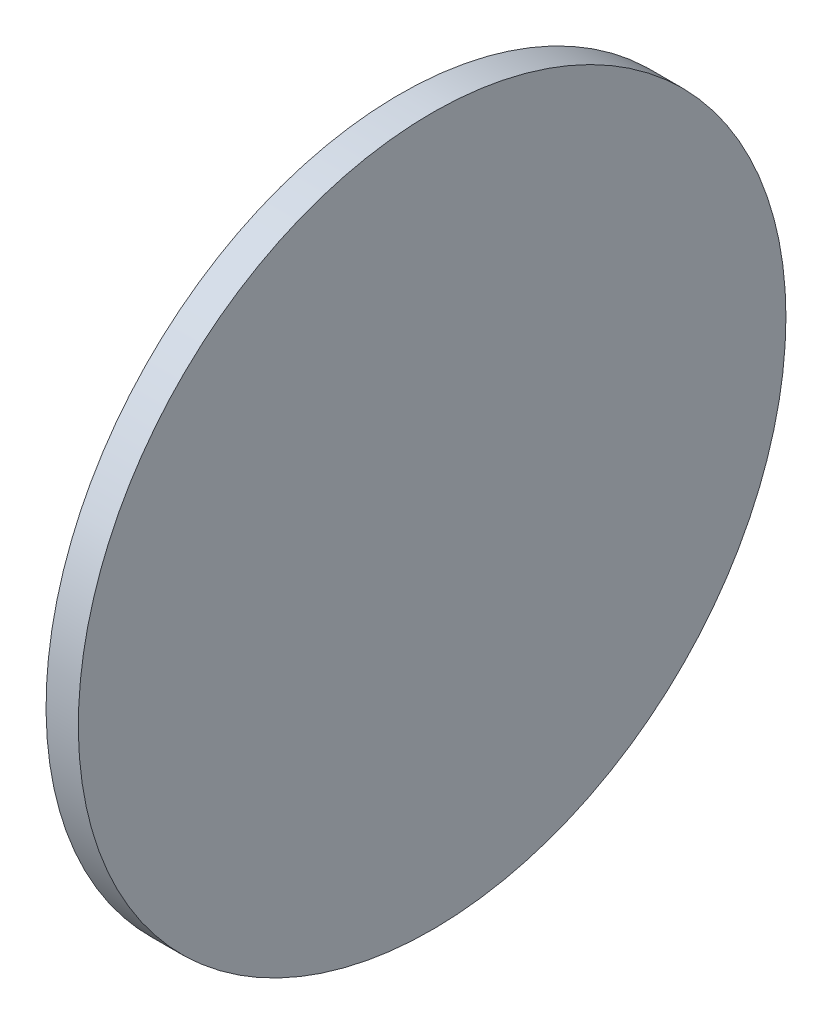
ISO-10303-21;
HEADER;
FILE_DESCRIPTION(('STEP AP214'),'2;1');
FILE_NAME('part.step','',(''),(''),'','','');
FILE_SCHEMA(('AUTOMOTIVE_DESIGN { 1 0 10303 214 1 1 1 1 }'));
ENDSEC;
DATA;
#1=APPLICATION_CONTEXT('core data for automotive mechanical design processes');
#2=APPLICATION_PROTOCOL_DEFINITION('international standard','automotive_design',2000,#1);
#3=PRODUCT_CONTEXT('',#1,'mechanical');
#4=PRODUCT('Part','Part','',(#3));
#5=PRODUCT_RELATED_PRODUCT_CATEGORY('part','',(#4));
#6=PRODUCT_DEFINITION_FORMATION('','',#4);
#7=PRODUCT_DEFINITION_CONTEXT('part definition',#1,'design');
#8=PRODUCT_DEFINITION('design','',#6,#7);
#9=PRODUCT_DEFINITION_SHAPE('','',#8);
#10=(LENGTH_UNIT() NAMED_UNIT(*) SI_UNIT(.MILLI.,.METRE.));
#11=(NAMED_UNIT(*) PLANE_ANGLE_UNIT() SI_UNIT($,.RADIAN.));
#12=(NAMED_UNIT(*) SI_UNIT($,.STERADIAN.) SOLID_ANGLE_UNIT());
#13=UNCERTAINTY_MEASURE_WITH_UNIT(LENGTH_MEASURE(1.E-05),#10,'distance_accuracy_value','');
#14=(GEOMETRIC_REPRESENTATION_CONTEXT(3) GLOBAL_UNCERTAINTY_ASSIGNED_CONTEXT((#13)) GLOBAL_UNIT_ASSIGNED_CONTEXT((#10,
#11,#12)) REPRESENTATION_CONTEXT('',''));
#15=CARTESIAN_POINT('',(0.,0.,0.));
#16=DIRECTION('',(0.,0.,1.));
#17=DIRECTION('',(1.,0.,0.));
#18=AXIS2_PLACEMENT_3D('',#15,#16,#17);
#19=CARTESIAN_POINT('',(160.522187488151,22.6971380761825,534.770617253154));
#20=CARTESIAN_POINT('',(160.522187488151,24.6488522827371,534.770617253154));
#21=CARTESIAN_POINT('',(160.522187488151,28.5522806958463,535.155071395465));
#22=CARTESIAN_POINT('',(160.522187488151,34.1824134682382,536.862953500239));
#23=CARTESIAN_POINT('',(160.522187488151,39.3711735483301,539.636403544825));
#24=CARTESIAN_POINT('',(160.522187488151,43.9191597961341,543.368839399378));
#25=CARTESIAN_POINT('',(160.522187488151,47.6515956506874,547.916825647182));
#26=CARTESIAN_POINT('',(160.522187488151,50.4250456952734,553.105585727274));
#27=CARTESIAN_POINT('',(160.522187488151,52.1329278000475,558.735718499666));
#28=CARTESIAN_POINT('',(160.522187488151,52.7096090135145,564.59086111933));
#29=CARTESIAN_POINT('',(160.522187488151,52.1329278000475,570.446003738994));
#30=CARTESIAN_POINT('',(160.522187488151,50.4250456952734,576.076136511386));
#31=CARTESIAN_POINT('',(160.522187488151,47.6515956506874,581.264896591478));
#32=CARTESIAN_POINT('',(160.522187488151,43.9191597961341,585.812882839282));
#33=CARTESIAN_POINT('',(160.522187488151,39.3711735483301,589.545318693835));
#34=CARTESIAN_POINT('',(160.522187488151,34.1824134682382,592.318768738421));
#35=CARTESIAN_POINT('',(160.522187488151,28.5522806958463,594.026650843195));
#36=CARTESIAN_POINT('',(160.522187488151,22.6971380761824,594.603332056662));
#37=CARTESIAN_POINT('',(160.522187488151,16.8419954565187,594.026650843195));
#38=CARTESIAN_POINT('',(160.522187488151,11.2118626841267,592.318768738421));
#39=CARTESIAN_POINT('',(160.522187488151,6.02310260403484,589.545318693835));
#40=CARTESIAN_POINT('',(160.522187488151,1.47511635623078,585.812882839282));
#41=CARTESIAN_POINT('',(160.522187488151,-2.25731949832244,581.264896591478));
#42=CARTESIAN_POINT('',(160.522187488151,-5.03076954290849,576.076136511386));
#43=CARTESIAN_POINT('',(160.522187488151,-6.73865164768257,570.446003738994));
#44=CARTESIAN_POINT('',(160.522187488151,-7.31533286114962,564.59086111933));
#45=CARTESIAN_POINT('',(160.522187488151,-6.73865164768257,558.735718499666));
#46=CARTESIAN_POINT('',(160.522187488151,-5.0307695429085,553.105585727274));
#47=CARTESIAN_POINT('',(160.522187488151,-2.25731949832244,547.916825647182));
#48=CARTESIAN_POINT('',(160.522187488151,1.47511635623078,543.368839399378));
#49=CARTESIAN_POINT('',(160.522187488151,6.02310260403483,539.636403544825));
#50=CARTESIAN_POINT('',(160.522187488151,11.2118626841267,536.862953500239));
#51=CARTESIAN_POINT('',(160.522187488151,16.8419954565186,535.155071395465));
#52=CARTESIAN_POINT('',(160.522187488151,20.7454238696279,534.770617253154));
#53=CARTESIAN_POINT('',(160.522187488151,22.6971380761825,534.770617253154));
#54=B_SPLINE_CURVE_WITH_KNOTS('',3,(#19,#20,#21,#22,#23,#24,#25,#26,#27,#28,#29,#30,#31,#32,#33,
#34,#35,#36,#37,#38,#39,#40,#41,#42,#43,#44,#45,#46,#47,#48,#49,#50,#51,#52,#53),.UNSPECIFIED.,
.T.,.F.,(4,1,1,1,1,1,1,1,1,1,1,1,1,1,1,1,1,1,1,1,1,1,1,1,1,1,1,1,1,1,1,1,4),(0.,0.03125,
0.0625000000000001,0.09375,0.125,0.15625,0.1875,0.21875,0.25,0.28125,0.3125,0.34375,0.375,
0.40625,0.4375,0.46875,0.5,0.53125,0.5625,0.59375,0.625,0.65625,0.6875,0.71875,0.75,0.78125,
0.8125,0.84375,0.875,0.90625,0.9375,0.96875,1.),.UNSPECIFIED.);
#55=DIRECTION('',(1.,0.,0.));
#56=VECTOR('',#55,1.);
#57=SURFACE_OF_LINEAR_EXTRUSION('',#54,#56);
#58=CARTESIAN_POINT('',(160.522187488151,22.6971380761825,534.770617253154));
#59=CARTESIAN_POINT('',(160.522187488151,24.6488522827371,534.770617253154));
#60=CARTESIAN_POINT('',(160.522187488151,28.5522806958463,535.155071395465));
#61=CARTESIAN_POINT('',(160.522187488151,34.1824134682382,536.862953500239));
#62=CARTESIAN_POINT('',(160.522187488151,39.3711735483301,539.636403544825));
#63=CARTESIAN_POINT('',(160.522187488151,43.9191597961341,543.368839399378));
#64=CARTESIAN_POINT('',(160.522187488151,47.6515956506874,547.916825647182));
#65=CARTESIAN_POINT('',(160.522187488151,50.4250456952734,553.105585727274));
#66=CARTESIAN_POINT('',(160.522187488151,52.1329278000475,558.735718499666));
#67=CARTESIAN_POINT('',(160.522187488151,52.7096090135145,564.59086111933));
#68=CARTESIAN_POINT('',(160.522187488151,52.1329278000475,570.446003738994));
#69=CARTESIAN_POINT('',(160.522187488151,50.4250456952734,576.076136511386));
#70=CARTESIAN_POINT('',(160.522187488151,47.6515956506874,581.264896591478));
#71=CARTESIAN_POINT('',(160.522187488151,43.9191597961341,585.812882839282));
#72=CARTESIAN_POINT('',(160.522187488151,39.3711735483301,589.545318693835));
#73=CARTESIAN_POINT('',(160.522187488151,34.1824134682382,592.318768738421));
#74=CARTESIAN_POINT('',(160.522187488151,28.5522806958463,594.026650843195));
#75=CARTESIAN_POINT('',(160.522187488151,22.6971380761824,594.603332056662));
#76=CARTESIAN_POINT('',(160.522187488151,16.8419954565187,594.026650843195));
#77=CARTESIAN_POINT('',(160.522187488151,11.2118626841267,592.318768738421));
#78=CARTESIAN_POINT('',(160.522187488151,6.02310260403484,589.545318693835));
#79=CARTESIAN_POINT('',(160.522187488151,1.47511635623078,585.812882839282));
#80=CARTESIAN_POINT('',(160.522187488151,-2.25731949832244,581.264896591478));
#81=CARTESIAN_POINT('',(160.522187488151,-5.03076954290849,576.076136511386));
#82=CARTESIAN_POINT('',(160.522187488151,-6.73865164768257,570.446003738994));
#83=CARTESIAN_POINT('',(160.522187488151,-7.31533286114962,564.59086111933));
#84=CARTESIAN_POINT('',(160.522187488151,-6.73865164768257,558.735718499666));
#85=CARTESIAN_POINT('',(160.522187488151,-5.0307695429085,553.105585727274));
#86=CARTESIAN_POINT('',(160.522187488151,-2.25731949832244,547.916825647182));
#87=CARTESIAN_POINT('',(160.522187488151,1.47511635623078,543.368839399378));
#88=CARTESIAN_POINT('',(160.522187488151,6.02310260403483,539.636403544825));
#89=CARTESIAN_POINT('',(160.522187488151,11.2118626841267,536.862953500239));
#90=CARTESIAN_POINT('',(160.522187488151,16.8419954565186,535.155071395465));
#91=CARTESIAN_POINT('',(160.522187488151,20.7454238696279,534.770617253154));
#92=CARTESIAN_POINT('',(160.522187488151,22.6971380761825,534.770617253154));
#93=B_SPLINE_CURVE_WITH_KNOTS('',3,(#58,#59,#60,#61,#62,#63,#64,#65,#66,#67,#68,#69,#70,#71,#72,
#73,#74,#75,#76,#77,#78,#79,#80,#81,#82,#83,#84,#85,#86,#87,#88,#89,#90,#91,#92),.UNSPECIFIED.,
.T.,.F.,(4,1,1,1,1,1,1,1,1,1,1,1,1,1,1,1,1,1,1,1,1,1,1,1,1,1,1,1,1,1,1,1,4),(0.,0.03125,
0.0625000000000001,0.09375,0.125,0.15625,0.1875,0.21875,0.25,0.28125,0.3125,0.34375,0.375,
0.40625,0.4375,0.46875,0.5,0.53125,0.5625,0.59375,0.625,0.65625,0.6875,0.71875,0.75,0.78125,
0.8125,0.84375,0.875,0.90625,0.9375,0.96875,1.),.UNSPECIFIED.);
#94=CARTESIAN_POINT('',(160.522187488151,22.6971380761825,534.770617253154));
#95=VERTEX_POINT('',#94);
#96=EDGE_CURVE('E9',#95,#95,#93,.T.);
#97=ORIENTED_EDGE('',*,*,#96,.T.);
#98=EDGE_LOOP('',(#97));
#99=FACE_BOUND('',#98,.T.);
#100=CARTESIAN_POINT('',(163.243459452108,22.6971380761825,534.770617253154));
#101=CARTESIAN_POINT('',(163.243459452108,22.209206528486,534.770617354361));
#102=CARTESIAN_POINT('',(163.243459452108,21.7212785318932,534.78263158858));
#103=CARTESIAN_POINT('',(163.243459452108,20.746594451324,534.830572830946));
#104=CARTESIAN_POINT('',(163.243459452108,20.2598383764803,534.866500024844));
#105=CARTESIAN_POINT('',(163.243459452108,19.2886705665237,534.962151690879));
#106=CARTESIAN_POINT('',(163.243459452108,18.8042588314108,535.021876163015));
#107=CARTESIAN_POINT('',(163.243459452108,17.8389491504251,535.165007686582));
#108=CARTESIAN_POINT('',(163.243459452108,17.358051177287,535.248414554046));
#109=CARTESIAN_POINT('',(163.243459452108,16.4009430181742,535.438795200653));
#110=CARTESIAN_POINT('',(163.243459452108,15.9247328321996,535.545768979795));
#111=CARTESIAN_POINT('',(163.243459452108,14.9781288439774,535.78294074304));
#112=CARTESIAN_POINT('',(163.243459452108,14.5077350869397,535.91313890754));
#113=CARTESIAN_POINT('',(163.243459452108,13.5738889928545,536.196418022795));
#114=CARTESIAN_POINT('',(163.243459452108,13.1104366558071,536.34949897355));
#115=CARTESIAN_POINT('',(163.243459452108,12.1915986284864,536.678202860723));
#116=CARTESIAN_POINT('',(163.243459452108,11.7362128755807,536.85382562203));
#117=CARTESIAN_POINT('',(163.243459452108,10.8346367234395,537.227270691719));
#118=CARTESIAN_POINT('',(163.243459452108,10.388446324204,537.425093000102));
#119=CARTESIAN_POINT('',(163.243459452108,9.50630097637823,537.842380852682));
#120=CARTESIAN_POINT('',(163.243459452108,9.07034610732267,538.061846564989));
#121=CARTESIAN_POINT('',(163.243459452108,8.2097086193634,538.521866886316));
#122=CARTESIAN_POINT('',(163.243459452108,7.7850260004597,538.762421495336));
#123=CARTESIAN_POINT('',(163.243459452108,6.94797013499257,539.264065836217));
#124=CARTESIAN_POINT('',(163.243459452108,6.53559679283769,539.525155408549));
#125=CARTESIAN_POINT('',(163.243459452108,5.72419969266128,540.067313617757));
#126=CARTESIAN_POINT('',(163.243459452108,5.32517593463976,540.348382254631));
#127=CARTESIAN_POINT('',(163.243459452108,4.54138958382106,540.929750058112));
#128=CARTESIAN_POINT('',(163.243459452108,4.15662710182709,541.230049374082));
#129=CARTESIAN_POINT('',(163.243459452108,3.40227203450267,541.849132578589));
#130=CARTESIAN_POINT('',(163.243459452108,3.03267944917222,542.167916467126));
#131=CARTESIAN_POINT('',(163.243459452108,2.30957333344479,542.823223350999));
#132=CARTESIAN_POINT('',(163.243459452108,1.95605967817079,543.159746208522));
#133=CARTESIAN_POINT('',(163.243459452108,1.26602316537437,543.849782721318));
#134=CARTESIAN_POINT('',(163.243459452108,0.929500307851959,544.203296376592));
#135=CARTESIAN_POINT('',(163.243459452108,0.274193423978741,544.92640249232));
#136=CARTESIAN_POINT('',(163.243459452108,-0.0445904645585054,545.29599507765));
#137=CARTESIAN_POINT('',(163.243459452108,-0.663673669065741,546.050350144975));
#138=CARTESIAN_POINT('',(163.243459452108,-0.963972985035732,546.435112626969));
#139=CARTESIAN_POINT('',(163.243459452108,-1.54534078851656,547.218898977787));
#140=CARTESIAN_POINT('',(163.243459452108,-1.82640942539103,547.617922735809));
#141=CARTESIAN_POINT('',(163.243459452108,-2.36856763459819,548.429319835985));
#142=CARTESIAN_POINT('',(163.243459452108,-2.62965720693087,548.841693178139));
#143=CARTESIAN_POINT('',(163.243459452108,-3.13130154781153,549.678749043608));
#144=CARTESIAN_POINT('',(163.243459452108,-3.3718561568317,550.103431662515));
#145=CARTESIAN_POINT('',(163.243459452108,-3.83187647815847,550.964069150466));
#146=CARTESIAN_POINT('',(163.243459452108,-4.05134219046507,551.400024019511));
#147=CARTESIAN_POINT('',(163.243459452108,-4.4686300430463,552.282169367366));
#148=CARTESIAN_POINT('',(163.243459452108,-4.66645235143123,552.728359766642));
#149=CARTESIAN_POINT('',(163.243459452108,-5.03989742111512,553.629935918674));
#150=CARTESIAN_POINT('',(163.243459452108,-5.21552018241408,554.085321671431));
#151=CARTESIAN_POINT('',(163.243459452108,-5.54422406960754,555.004159699158));
#152=CARTESIAN_POINT('',(163.243459452108,-5.69730502039054,555.467612036761));
#153=CARTESIAN_POINT('',(163.243459452108,-5.9805841355706,556.401458129328));
#154=CARTESIAN_POINT('',(163.243459452108,-6.11078229996764,556.871851884293));
#155=CARTESIAN_POINT('',(163.243459452108,-6.34795406349232,557.818455878179));
#156=CARTESIAN_POINT('',(163.243459452108,-6.45492784301653,558.29466607189));
#157=CARTESIAN_POINT('',(163.243459452108,-6.64530848857962,559.251774209866));
#158=CARTESIAN_POINT('',(163.243459452108,-6.72871535461851,559.732672154131));
#159=CARTESIAN_POINT('',(163.243459452108,-6.87184688207918,560.697981914001));
#160=CARTESIAN_POINT('',(163.243459452108,-6.93157135953521,561.182393756873));
#161=CARTESIAN_POINT('',(163.243459452108,-7.02722301103694,562.153561272426));
#162=CARTESIAN_POINT('',(163.243459452108,-7.06315018508264,562.640316945107));
#163=CARTESIAN_POINT('',(163.243459452108,-7.11109148168599,563.615002124401));
#164=CARTESIAN_POINT('',(163.243459452108,-7.12310578999394,564.102931621865));
#165=CARTESIAN_POINT('',(163.243459452108,-7.12310578999393,565.078790616795));
#166=CARTESIAN_POINT('',(163.243459452108,-7.11109148168599,565.566720114259));
#167=CARTESIAN_POINT('',(163.243459452108,-7.06315018508264,566.541405293553));
#168=CARTESIAN_POINT('',(163.243459452108,-7.02722301103694,567.028160966234));
#169=CARTESIAN_POINT('',(163.243459452108,-6.93157135953521,567.999328481787));
#170=CARTESIAN_POINT('',(163.243459452108,-6.87184688207917,568.483740324659));
#171=CARTESIAN_POINT('',(163.243459452108,-6.72871535461851,569.44905008453));
#172=CARTESIAN_POINT('',(163.243459452108,-6.64530848857961,569.929948028794));
#173=CARTESIAN_POINT('',(163.243459452108,-6.45492784301652,570.88705616677));
#174=CARTESIAN_POINT('',(163.243459452108,-6.34795406349232,571.363266360481));
#175=CARTESIAN_POINT('',(163.243459452108,-6.11078229996763,572.309870354367));
#176=CARTESIAN_POINT('',(163.243459452108,-5.98058413557057,572.780264109331));
#177=CARTESIAN_POINT('',(163.243459452108,-5.69730502039053,573.714110201899));
#178=CARTESIAN_POINT('',(163.243459452108,-5.54422406960753,574.177562539502));
#179=CARTESIAN_POINT('',(163.243459452108,-5.21552018241408,575.096400567229));
#180=CARTESIAN_POINT('',(163.243459452108,-5.03989742111512,575.551786319986));
#181=CARTESIAN_POINT('',(163.243459452108,-4.66645235143123,576.453362472019));
#182=CARTESIAN_POINT('',(163.243459452108,-4.46863004304629,576.899552871294));
#183=CARTESIAN_POINT('',(163.243459452108,-4.05134219046505,577.781698219149));
#184=CARTESIAN_POINT('',(163.243459452108,-3.83187647815845,578.217653088194));
#185=CARTESIAN_POINT('',(163.243459452108,-3.37185615683168,579.078290576145));
#186=CARTESIAN_POINT('',(163.243459452108,-3.13130154781151,579.502973195052));
#187=CARTESIAN_POINT('',(163.243459452108,-2.62965720693086,580.340029060521));
#188=CARTESIAN_POINT('',(163.243459452108,-2.3685676345982,580.752402402675));
#189=CARTESIAN_POINT('',(163.243459452108,-1.82640942539104,581.563799502851));
#190=CARTESIAN_POINT('',(163.243459452108,-1.54534078851654,581.962823260873));
#191=CARTESIAN_POINT('',(163.243459452108,-0.963972985035715,582.746609611691));
#192=CARTESIAN_POINT('',(163.243459452108,-0.663673669065743,583.131372093685));
#193=CARTESIAN_POINT('',(163.243459452108,-0.0445904645585082,583.88572716101));
#194=CARTESIAN_POINT('',(163.243459452108,0.274193423978755,584.25531974634));
#195=CARTESIAN_POINT('',(163.243459452108,0.929500307851978,584.978425862068));
#196=CARTESIAN_POINT('',(163.243459452108,1.26602316537438,585.331939517342));
#197=CARTESIAN_POINT('',(163.243459452108,1.95605967817079,586.021976030138));
#198=CARTESIAN_POINT('',(163.243459452108,2.30957333344481,586.35849888766));
#199=CARTESIAN_POINT('',(163.243459452108,3.03267944917224,587.013805771534));
#200=CARTESIAN_POINT('',(163.243459452108,3.40227203450267,587.332589660071));
#201=CARTESIAN_POINT('',(163.243459452108,4.15662710182706,587.951672864578));
#202=CARTESIAN_POINT('',(163.243459452108,4.541389583821,588.251972180548));
#203=CARTESIAN_POINT('',(163.243459452108,5.32517593463986,588.833339984029));
#204=CARTESIAN_POINT('',(163.243459452108,5.72419969266156,589.114408620903));
#205=CARTESIAN_POINT('',(163.243459452108,6.5355967928374,589.656566830111));
#206=CARTESIAN_POINT('',(163.243459452108,6.94797013499154,589.917656402443));
#207=CARTESIAN_POINT('',(163.243459452108,7.78502600046076,590.419300743324));
#208=CARTESIAN_POINT('',(163.243459452108,8.20970861936731,590.659855352344));
#209=CARTESIAN_POINT('',(163.243459452108,9.07034610731875,591.119875673671));
#210=CARTESIAN_POINT('',(163.243459452108,9.50630097636364,591.339341385977));
#211=CARTESIAN_POINT('',(163.243459452108,10.3884463242186,591.756629238559));
#212=CARTESIAN_POINT('',(163.243459452108,10.834636723494,591.954451546944));
#213=CARTESIAN_POINT('',(163.243459452108,11.7362128755262,592.327896616628));
#214=CARTESIAN_POINT('',(163.243459452108,12.1915986282831,592.503519377927));
#215=CARTESIAN_POINT('',(163.243459452108,13.1104366560105,592.83222326512));
#216=CARTESIAN_POINT('',(163.243459452108,13.5738889936133,592.985304215903));
#217=CARTESIAN_POINT('',(163.243459452108,14.5077350861809,593.268583331083));
#218=CARTESIAN_POINT('',(163.243459452108,14.9781288411456,593.39878149548));
#219=CARTESIAN_POINT('',(163.243459452108,15.9247328350315,593.635953259005));
#220=CARTESIAN_POINT('',(163.243459452108,16.4009430287428,593.742927038529));
#221=CARTESIAN_POINT('',(163.243459452108,17.3580511667185,593.933307684092));
#222=CARTESIAN_POINT('',(163.243459452108,17.838949110983,594.016714550131));
#223=CARTESIAN_POINT('',(163.243459452108,18.8042588708533,594.159846077592));
#224=CARTESIAN_POINT('',(163.243459452108,19.2886707137254,594.219570555048));
#225=CARTESIAN_POINT('',(163.243459452108,20.2598382292787,594.315222206549));
#226=CARTESIAN_POINT('',(163.243459452108,20.7465939019598,594.351149380595));
#227=CARTESIAN_POINT('',(163.243459452108,21.7212790812531,594.399090677198));
#228=CARTESIAN_POINT('',(163.243459452108,22.2092085787178,594.411104985506));
#229=CARTESIAN_POINT('',(163.243459452108,23.1850675736471,594.411104985506));
#230=CARTESIAN_POINT('',(163.243459452108,23.6729970711118,594.399090677199));
#231=CARTESIAN_POINT('',(163.243459452108,24.6476822504051,594.351149380595));
#232=CARTESIAN_POINT('',(163.243459452108,25.1344379230862,594.315222206549));
#233=CARTESIAN_POINT('',(163.243459452108,26.1056054386395,594.219570555048));
#234=CARTESIAN_POINT('',(163.243459452108,26.5900172815116,594.159846077592));
#235=CARTESIAN_POINT('',(163.243459452108,27.5553270413819,594.016714550131));
#236=CARTESIAN_POINT('',(163.243459452108,28.0362249856464,593.933307684092));
#237=CARTESIAN_POINT('',(163.243459452108,28.9933331236222,593.742927038529));
#238=CARTESIAN_POINT('',(163.243459452108,29.4695433173335,593.635953259005));
#239=CARTESIAN_POINT('',(163.243459452108,30.4161473112193,593.39878149548));
#240=CARTESIAN_POINT('',(163.243459452108,30.886541066184,593.268583331083));
#241=CARTESIAN_POINT('',(163.243459452108,31.8203871587516,592.985304215903));
#242=CARTESIAN_POINT('',(163.243459452108,32.2838394963545,592.83222326512));
#243=CARTESIAN_POINT('',(163.243459452108,33.2026775240818,592.503519377926));
#244=CARTESIAN_POINT('',(163.243459452108,33.6580632768387,592.327896616627));
#245=CARTESIAN_POINT('',(163.243459452108,34.559639428871,591.954451546944));
#246=CARTESIAN_POINT('',(163.243459452108,35.0058298281463,591.756629238559));
#247=CARTESIAN_POINT('',(163.243459452108,35.8879751760013,591.339341385977));
#248=CARTESIAN_POINT('',(163.243459452108,36.3239300450462,591.119875673671));
#249=CARTESIAN_POINT('',(163.243459452108,37.1845675329976,590.659855352344));
#250=CARTESIAN_POINT('',(163.243459452108,37.6092501519042,590.419300743324));
#251=CARTESIAN_POINT('',(163.243459452108,38.4463060173734,589.917656402443));
#252=CARTESIAN_POINT('',(163.243459452108,38.8586793595275,589.656566830111));
#253=CARTESIAN_POINT('',(163.243459452108,39.6700764597034,589.114408620903));
#254=CARTESIAN_POINT('',(163.243459452108,40.0691002177251,588.833339984029));
#255=CARTESIAN_POINT('',(163.243459452108,40.8528865685439,588.251972180548));
#256=CARTESIAN_POINT('',(163.243459452108,41.2376490505379,587.951672864578));
#257=CARTESIAN_POINT('',(163.243459452108,41.9920041178622,587.332589660071));
#258=CARTESIAN_POINT('',(163.243459452108,42.3615967031927,587.013805771534));
#259=CARTESIAN_POINT('',(163.243459452108,43.0847028189201,586.35849888766));
#260=CARTESIAN_POINT('',(163.243459452108,43.4382164741941,586.021976030138));
#261=CARTESIAN_POINT('',(163.243459452108,44.1282529869905,585.331939517342));
#262=CARTESIAN_POINT('',(163.243459452108,44.4647758445129,584.978425862068));
#263=CARTESIAN_POINT('',(163.243459452108,45.1200827283861,584.25531974634));
#264=CARTESIAN_POINT('',(163.243459452108,45.4388666169234,583.88572716101));
#265=CARTESIAN_POINT('',(163.243459452108,46.0579498214307,583.131372093685));
#266=CARTESIAN_POINT('',(163.243459452108,46.3582491374006,582.746609611691));
#267=CARTESIAN_POINT('',(163.243459452108,46.9396169408815,581.962823260873));
#268=CARTESIAN_POINT('',(163.243459452108,47.2206855777559,581.563799502851));
#269=CARTESIAN_POINT('',(163.243459452108,47.7628437869631,580.752402402675));
#270=CARTESIAN_POINT('',(163.243459452108,48.0239333592958,580.340029060521));
#271=CARTESIAN_POINT('',(163.243459452108,48.5255777001764,579.502973195052));
#272=CARTESIAN_POINT('',(163.243459452108,48.7661323091966,579.078290576145));
#273=CARTESIAN_POINT('',(163.243459452108,49.2261526305233,578.217653088194));
#274=CARTESIAN_POINT('',(163.243459452108,49.4456183428299,577.781698219149));
#275=CARTESIAN_POINT('',(163.243459452108,49.8629061954111,576.899552871294));
#276=CARTESIAN_POINT('',(163.243459452108,50.0607285037961,576.453362472019));
#277=CARTESIAN_POINT('',(163.243459452108,50.43417357348,575.551786319986));
#278=CARTESIAN_POINT('',(163.243459452108,50.609796334779,575.096400567229));
#279=CARTESIAN_POINT('',(163.243459452108,50.9385002219724,574.177562539502));
#280=CARTESIAN_POINT('',(163.243459452108,51.0915811727554,573.714110201899));
#281=CARTESIAN_POINT('',(163.243459452108,51.3748602879355,572.780264109331));
#282=CARTESIAN_POINT('',(163.243459452108,51.5050584523325,572.309870354367));
#283=CARTESIAN_POINT('',(163.243459452108,51.7422302158572,571.363266360481));
#284=CARTESIAN_POINT('',(163.243459452108,51.8492039953814,570.88705616677));
#285=CARTESIAN_POINT('',(163.243459452108,52.0395846409445,569.929948028794));
#286=CARTESIAN_POINT('',(163.243459452108,52.1229915069834,569.44905008453));
#287=CARTESIAN_POINT('',(163.243459452108,52.2661230344441,568.483740324659));
#288=CARTESIAN_POINT('',(163.243459452108,52.3258475119001,567.999328481787));
#289=CARTESIAN_POINT('',(163.243459452108,52.4214991634019,567.028160966234));
#290=CARTESIAN_POINT('',(163.243459452108,52.4574263374476,566.541405293553));
#291=CARTESIAN_POINT('',(163.243459452108,52.5053676340509,565.566720114259));
#292=CARTESIAN_POINT('',(163.243459452108,52.5173819423589,565.078790616795));
#293=CARTESIAN_POINT('',(163.243459452108,52.5173819423589,564.102931621865));
#294=CARTESIAN_POINT('',(163.243459452108,52.5053676340509,563.615002124401));
#295=CARTESIAN_POINT('',(163.243459452108,52.4574263374476,562.640316945107));
#296=CARTESIAN_POINT('',(163.243459452108,52.4214991634018,562.153561272426));
#297=CARTESIAN_POINT('',(163.243459452108,52.3258475119001,561.182393756873));
#298=CARTESIAN_POINT('',(163.243459452108,52.2661230344441,560.697981914001));
#299=CARTESIAN_POINT('',(163.243459452108,52.1229915069834,559.73267215413));
#300=CARTESIAN_POINT('',(163.243459452108,52.0395846409445,559.251774209866));
#301=CARTESIAN_POINT('',(163.243459452108,51.8492039953814,558.29466607189));
#302=CARTESIAN_POINT('',(163.243459452108,51.7422302158572,557.818455878179));
#303=CARTESIAN_POINT('',(163.243459452108,51.5050584523325,556.871851884293));
#304=CARTESIAN_POINT('',(163.243459452108,51.3748602879355,556.401458129328));
#305=CARTESIAN_POINT('',(163.243459452108,51.0915811727554,555.467612036761));
#306=CARTESIAN_POINT('',(163.243459452108,50.9385002219724,555.004159699158));
#307=CARTESIAN_POINT('',(163.243459452108,50.609796334779,554.085321671431));
#308=CARTESIAN_POINT('',(163.243459452108,50.43417357348,553.629935918674));
#309=CARTESIAN_POINT('',(163.243459452108,50.0607285037961,552.728359766641));
#310=CARTESIAN_POINT('',(163.243459452108,49.8629061954112,552.282169367366));
#311=CARTESIAN_POINT('',(163.243459452108,49.4456183428299,551.400024019511));
#312=CARTESIAN_POINT('',(163.243459452108,49.2261526305234,550.964069150466));
#313=CARTESIAN_POINT('',(163.243459452108,48.7661323091966,550.103431662515));
#314=CARTESIAN_POINT('',(163.243459452108,48.5255777001764,549.678749043608));
#315=CARTESIAN_POINT('',(163.243459452108,48.0239333592958,548.841693178139));
#316=CARTESIAN_POINT('',(163.243459452108,47.7628437869631,548.429319835985));
#317=CARTESIAN_POINT('',(163.243459452108,47.2206855777559,547.617922735809));
#318=CARTESIAN_POINT('',(163.243459452108,46.9396169408814,547.218898977788));
#319=CARTESIAN_POINT('',(163.243459452108,46.3582491374006,546.435112626969));
#320=CARTESIAN_POINT('',(163.243459452108,46.0579498214307,546.050350144975));
#321=CARTESIAN_POINT('',(163.243459452108,45.4388666169234,545.29599507765));
#322=CARTESIAN_POINT('',(163.243459452108,45.1200827283861,544.92640249232));
#323=CARTESIAN_POINT('',(163.243459452108,44.4647758445129,544.203296376592));
#324=CARTESIAN_POINT('',(163.243459452108,44.1282529869905,543.849782721318));
#325=CARTESIAN_POINT('',(163.243459452108,43.4382164741941,543.159746208522));
#326=CARTESIAN_POINT('',(163.243459452108,43.0847028189201,542.823223350999));
#327=CARTESIAN_POINT('',(163.243459452108,42.3615967031927,542.167916467126));
#328=CARTESIAN_POINT('',(163.243459452108,41.9920041178622,541.849132578589));
#329=CARTESIAN_POINT('',(163.243459452108,41.2376490505378,541.230049374082));
#330=CARTESIAN_POINT('',(163.243459452108,40.8528865685438,540.929750058112));
#331=CARTESIAN_POINT('',(163.243459452108,40.0691002177251,540.348382254631));
#332=CARTESIAN_POINT('',(163.243459452108,39.6700764597036,540.067313617757));
#333=CARTESIAN_POINT('',(163.243459452108,38.8586793595272,539.525155408549));
#334=CARTESIAN_POINT('',(163.243459452108,38.4463060173723,539.264065836217));
#335=CARTESIAN_POINT('',(163.243459452108,37.6092501519052,538.762421495336));
#336=CARTESIAN_POINT('',(163.243459452108,37.1845675330015,538.521866886316));
#337=CARTESIAN_POINT('',(163.243459452108,36.3239300450422,538.061846564989));
#338=CARTESIAN_POINT('',(163.243459452108,35.8879751759867,537.842380852682));
#339=CARTESIAN_POINT('',(163.243459452108,35.0058298281609,537.425093000102));
#340=CARTESIAN_POINT('',(163.243459452108,34.5596394289254,537.227270691719));
#341=CARTESIAN_POINT('',(163.243459452108,33.6580632767842,536.85382562203));
#342=CARTESIAN_POINT('',(163.243459452108,33.2026775238785,536.678202860723));
#343=CARTESIAN_POINT('',(163.243459452108,32.2838394965578,536.34949897355));
#344=CARTESIAN_POINT('',(163.243459452108,31.8203871595104,536.196418022795));
#345=CARTESIAN_POINT('',(163.243459452108,30.8865410654252,535.91313890754));
#346=CARTESIAN_POINT('',(163.243459452108,30.4161473083874,535.78294074304));
#347=CARTESIAN_POINT('',(163.243459452108,29.4695433201653,535.545768979795));
#348=CARTESIAN_POINT('',(163.243459452108,28.9933331341906,535.438795200653));
#349=CARTESIAN_POINT('',(163.243459452108,28.0362249750779,535.248414554046));
#350=CARTESIAN_POINT('',(163.243459452108,27.5553270019398,535.165007686582));
#351=CARTESIAN_POINT('',(163.243459452108,26.5900173209541,535.021876163015));
#352=CARTESIAN_POINT('',(163.243459452108,26.1056055858412,534.962151690879));
#353=CARTESIAN_POINT('',(163.243459452108,25.1344377758846,534.866500024844));
#354=CARTESIAN_POINT('',(163.243459452108,24.6476817010409,534.830572830946));
#355=CARTESIAN_POINT('',(163.243459452108,23.6729976204717,534.78263158858));
#356=CARTESIAN_POINT('',(163.243459452108,23.185069623879,534.770617354361));
#357=CARTESIAN_POINT('',(163.243459452108,22.6971380761825,534.770617253154));
#358=B_SPLINE_CURVE_WITH_KNOTS('',3,(#100,#101,#102,#103,#104,#105,#106,#107,#108,#109,#110,
#111,#112,#113,#114,#115,#116,#117,#118,#119,#120,#121,#122,#123,#124,#125,#126,#127,#128,#129,
#130,#131,#132,#133,#134,#135,#136,#137,#138,#139,#140,#141,#142,#143,#144,#145,#146,#147,#148,
#149,#150,#151,#152,#153,#154,#155,#156,#157,#158,#159,#160,#161,#162,#163,#164,#165,#166,#167,
#168,#169,#170,#171,#172,#173,#174,#175,#176,#177,#178,#179,#180,#181,#182,#183,#184,#185,#186,
#187,#188,#189,#190,#191,#192,#193,#194,#195,#196,#197,#198,#199,#200,#201,#202,#203,#204,#205,
#206,#207,#208,#209,#210,#211,#212,#213,#214,#215,#216,#217,#218,#219,#220,#221,#222,#223,#224,
#225,#226,#227,#228,#229,#230,#231,#232,#233,#234,#235,#236,#237,#238,#239,#240,#241,#242,#243,
#244,#245,#246,#247,#248,#249,#250,#251,#252,#253,#254,#255,#256,#257,#258,#259,#260,#261,#262,
#263,#264,#265,#266,#267,#268,#269,#270,#271,#272,#273,#274,#275,#276,#277,#278,#279,#280,#281,
#282,#283,#284,#285,#286,#287,#288,#289,#290,#291,#292,#293,#294,#295,#296,#297,#298,#299,#300,
#301,#302,#303,#304,#305,#306,#307,#308,#309,#310,#311,#312,#313,#314,#315,#316,#317,#318,#319,
#320,#321,#322,#323,#324,#325,#326,#327,#328,#329,#330,#331,#332,#333,#334,#335,#336,#337,#338,
#339,#340,#341,#342,#343,#344,#345,#346,#347,#348,#349,#350,#351,#352,#353,#354,#355,#356,#357),
.UNSPECIFIED.,.F.,.F.,(4,2,2,2,2,2,2,2,2,2,2,2,2,2,2,2,2,2,2,2,2,2,2,2,2,2,2,2,2,2,2,2,2,2,2,2,
2,2,2,2,2,2,2,2,2,2,2,2,2,2,2,2,2,2,2,2,2,2,2,2,2,2,2,2,2,2,2,2,2,2,2,2,2,2,2,2,2,2,2,2,2,2,2,2,
2,2,2,2,2,2,2,2,2,2,2,2,2,2,2,2,2,2,2,2,2,2,2,2,2,2,2,2,2,2,2,2,2,2,2,2,2,2,2,2,2,2,2,2,4),(0.,
1.4636421175969,2.92729560460172,4.39094909160656,5.85459120920345,7.31823332680033,
8.78188681380516,10.2455403008099,11.7091824184068,13.1728245360037,14.6364780230085,
16.1001315100133,17.5637736276102,19.0274157452071,20.491069232212,21.9547227192167,
23.4183648368136,24.8820069544104,26.3456604414154,27.8093139284202,29.2729560460171,
30.736598163614,32.2002516506189,33.6639051376237,35.1275472552206,36.5911893728175,
38.0548428598222,39.518496346827,40.9821384644239,42.4457805820208,43.9094340690257,
45.3730875560304,46.8367296736273,48.3003717912242,49.764025278229,51.2276787652339,
52.6913208828307,54.1549630004276,55.6186164874324,57.0822699744373,58.5459120920342,
60.009554209631,61.4732076966357,62.9368611836406,64.4005033012376,65.8641454188344,
67.3277989058392,68.7914523928441,70.2550945104409,71.7187366280378,73.1823901150426,
74.6460436020475,76.1096857196444,77.5733278372413,79.0369813242461,80.5006348112509,
81.9642769288478,83.4279190464447,84.8915725334495,86.3552260204543,87.8188681380512,
89.282510255648,90.7461637426529,92.2098172296577,93.6734593472546,95.1371014648514,
96.6007549518563,98.0644084388611,99.528050556458,100.991692674055,102.45534616106,
103.918999648065,105.382641765661,106.846283883258,108.309937370263,109.773590857268,
111.237232974865,112.700875092462,114.164528579466,115.628182066471,117.091824184068,
118.555466301665,120.01911978867,121.482773275675,122.946415393272,124.410057510868,
125.873710997873,127.337364484878,128.801006602475,130.264648720072,131.728302207077,
133.191955694082,134.655597811678,136.119239929275,137.58289341628,139.046546903285,
140.510189020882,141.973831138479,143.437484625483,144.901138112488,146.364780230085,
147.828422347682,149.292075834687,150.755729321692,152.219371439289,153.683013556885,
155.14666704389,156.610320530895,158.073962648492,159.537604766089,161.001258253094,
162.464911740098,163.928553857695,165.392195975292,166.855849462297,168.319502949302,
169.783145066899,171.246787184496,172.710440671501,174.174094158505,175.637736276102,
177.101378393699,178.565031880704,180.028685367709,181.492327485306,182.955969602903,
184.419623089907,185.883276576912,187.346918694509),.UNSPECIFIED.);
#359=CARTESIAN_POINT('',(163.243459452108,22.6971380761825,534.770617253154));
#360=VERTEX_POINT('',#359);
#361=EDGE_CURVE('E24',#360,#360,#358,.F.);
#362=ORIENTED_EDGE('',*,*,#361,.F.);
#363=EDGE_LOOP('',(#362));
#364=FACE_BOUND('',#363,.T.);
#365=ADVANCED_FACE('F14',(#99,#364),#57,.T.);
#366=CARTESIAN_POINT('',(160.522187488151,22.6971380761825,496.59086111933));
#367=DIRECTION('',(1.,0.,0.));
#368=DIRECTION('',(0.,1.,0.));
#369=AXIS2_PLACEMENT_3D('',#366,#367,#368);
#370=PLANE('',#369);
#371=ORIENTED_EDGE('',*,*,#96,.F.);
#372=EDGE_LOOP('',(#371));
#373=FACE_BOUND('',#372,.T.);
#374=ADVANCED_FACE('F62',(#373),#370,.F.);
#375=CARTESIAN_POINT('',(163.243459452108,22.6971380761825,496.59086111933));
#376=DIRECTION('',(1.,0.,0.));
#377=DIRECTION('',(0.,1.,0.));
#378=AXIS2_PLACEMENT_3D('',#375,#376,#377);
#379=PLANE('',#378);
#380=ORIENTED_EDGE('',*,*,#361,.T.);
#381=EDGE_LOOP('',(#380));
#382=FACE_BOUND('',#381,.T.);
#383=ADVANCED_FACE('F31',(#382),#379,.T.);
#384=CLOSED_SHELL('',(#365,#374,#383));
#385=MANIFOLD_SOLID_BREP('B1',#384);
#386=ADVANCED_BREP_SHAPE_REPRESENTATION('',(#18,#385),#14);
#387=SHAPE_DEFINITION_REPRESENTATION(#9,#386);
ENDSEC;
END-ISO-10303-21;
